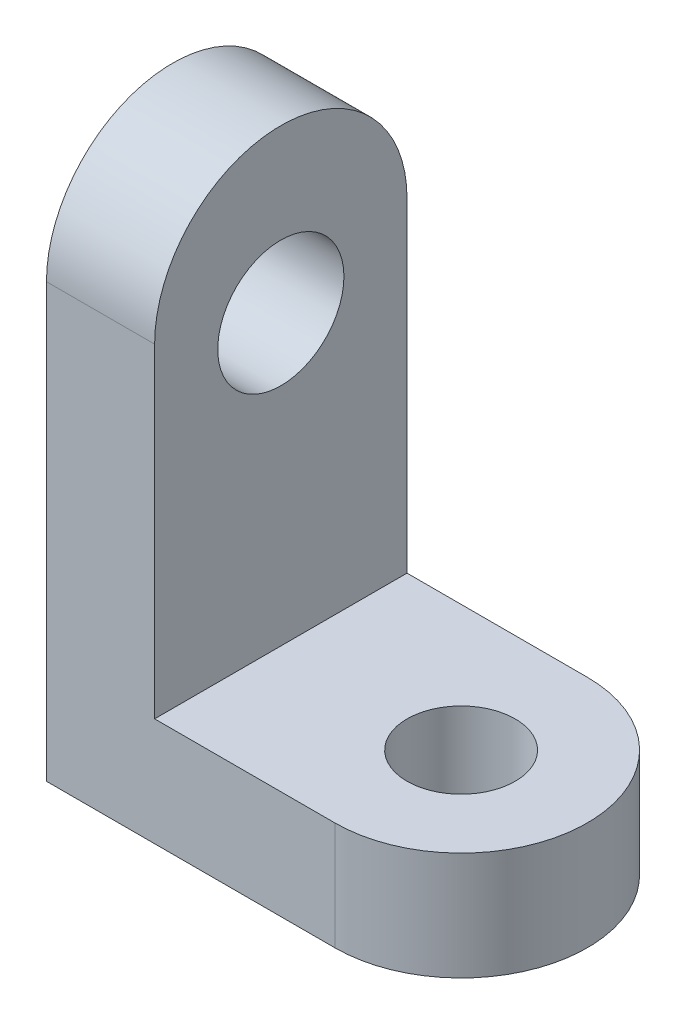
ISO-10303-21;
HEADER;
FILE_DESCRIPTION(('STEP AP214'),'2;1');
FILE_NAME('part.step','',(''),(''),'','','');
FILE_SCHEMA(('AUTOMOTIVE_DESIGN { 1 0 10303 214 1 1 1 1 }'));
ENDSEC;
DATA;
#1=APPLICATION_CONTEXT('core data for automotive mechanical design processes');
#2=APPLICATION_PROTOCOL_DEFINITION('international standard','automotive_design',2000,#1);
#3=PRODUCT_CONTEXT('',#1,'mechanical');
#4=PRODUCT('Part','Part','',(#3));
#5=PRODUCT_RELATED_PRODUCT_CATEGORY('part','',(#4));
#6=PRODUCT_DEFINITION_FORMATION('','',#4);
#7=PRODUCT_DEFINITION_CONTEXT('part definition',#1,'design');
#8=PRODUCT_DEFINITION('design','',#6,#7);
#9=PRODUCT_DEFINITION_SHAPE('','',#8);
#10=(LENGTH_UNIT() NAMED_UNIT(*) SI_UNIT(.MILLI.,.METRE.));
#11=(NAMED_UNIT(*) PLANE_ANGLE_UNIT() SI_UNIT($,.RADIAN.));
#12=(NAMED_UNIT(*) SI_UNIT($,.STERADIAN.) SOLID_ANGLE_UNIT());
#13=UNCERTAINTY_MEASURE_WITH_UNIT(LENGTH_MEASURE(1.E-05),#10,'distance_accuracy_value','');
#14=(GEOMETRIC_REPRESENTATION_CONTEXT(3) GLOBAL_UNCERTAINTY_ASSIGNED_CONTEXT((#13)) GLOBAL_UNIT_ASSIGNED_CONTEXT((#10,
#11,#12)) REPRESENTATION_CONTEXT('',''));
#15=CARTESIAN_POINT('',(0.,0.,0.));
#16=DIRECTION('',(0.,0.,1.));
#17=DIRECTION('',(1.,0.,0.));
#18=AXIS2_PLACEMENT_3D('',#15,#16,#17);
#19=CARTESIAN_POINT('',(-5.,12.,0.));
#20=DIRECTION('',(1.,0.,0.));
#21=DIRECTION('',(0.,0.,-1.));
#22=AXIS2_PLACEMENT_3D('',#19,#20,#21);
#23=CYLINDRICAL_SURFACE('',#22,3.5);
#24=DIRECTION('',(-1.,0.,0.));
#25=VECTOR('',#24,1.);
#26=CARTESIAN_POINT('',(-5.,12.,3.5));
#27=LINE('',#26,#25);
#28=CARTESIAN_POINT('',(-5.,12.,3.5));
#29=VERTEX_POINT('',#28);
#30=CARTESIAN_POINT('',(-8.,12.,3.5));
#31=VERTEX_POINT('',#30);
#32=EDGE_CURVE('E130',#29,#31,#27,.T.);
#33=ORIENTED_EDGE('',*,*,#32,.F.);
#34=CARTESIAN_POINT('',(-5.,12.,0.));
#35=DIRECTION('',(-1.,0.,0.));
#36=DIRECTION('',(0.,0.,1.));
#37=AXIS2_PLACEMENT_3D('',#34,#35,#36);
#38=CIRCLE('',#37,3.5);
#39=CARTESIAN_POINT('',(-5.,12.,-3.5));
#40=VERTEX_POINT('',#39);
#41=EDGE_CURVE('E42',#40,#29,#38,.F.);
#42=ORIENTED_EDGE('',*,*,#41,.F.);
#43=DIRECTION('',(-1.,0.,0.));
#44=VECTOR('',#43,1.);
#45=CARTESIAN_POINT('',(-5.,12.,-3.5));
#46=LINE('',#45,#44);
#47=CARTESIAN_POINT('',(-8.,12.,-3.5));
#48=VERTEX_POINT('',#47);
#49=EDGE_CURVE('E90',#48,#40,#46,.F.);
#50=ORIENTED_EDGE('',*,*,#49,.F.);
#51=CARTESIAN_POINT('',(-8.,12.,0.));
#52=DIRECTION('',(1.,0.,0.));
#53=DIRECTION('',(0.,0.,-1.));
#54=AXIS2_PLACEMENT_3D('',#51,#52,#53);
#55=CIRCLE('',#54,3.5);
#56=EDGE_CURVE('E11',#31,#48,#55,.F.);
#57=ORIENTED_EDGE('',*,*,#56,.F.);
#58=EDGE_LOOP('',(#33,#42,#50,#57));
#59=FACE_BOUND('',#58,.T.);
#60=ADVANCED_FACE('F35',(#59),#23,.T.);
#61=CARTESIAN_POINT('',(0.,3.,3.5));
#62=DIRECTION('',(0.,0.,-1.));
#63=DIRECTION('',(-1.,0.,0.));
#64=AXIS2_PLACEMENT_3D('',#61,#62,#63);
#65=PLANE('',#64);
#66=DIRECTION('',(0.,-1.,0.));
#67=VECTOR('',#66,1.);
#68=CARTESIAN_POINT('',(-5.,15.5,3.5));
#69=LINE('',#68,#67);
#70=CARTESIAN_POINT('',(-5.,3.,3.5));
#71=VERTEX_POINT('',#70);
#72=EDGE_CURVE('E93',#29,#71,#69,.T.);
#73=ORIENTED_EDGE('',*,*,#72,.F.);
#74=ORIENTED_EDGE('',*,*,#32,.T.);
#75=DIRECTION('',(0.,-1.,0.));
#76=VECTOR('',#75,1.);
#77=CARTESIAN_POINT('',(-8.,3.,3.5));
#78=LINE('',#77,#76);
#79=CARTESIAN_POINT('',(-8.,0.,3.5));
#80=VERTEX_POINT('',#79);
#81=EDGE_CURVE('E135',#31,#80,#78,.T.);
#82=ORIENTED_EDGE('',*,*,#81,.T.);
#83=DIRECTION('',(1.,0.,0.));
#84=VECTOR('',#83,1.);
#85=CARTESIAN_POINT('',(0.,0.,3.5));
#86=LINE('',#85,#84);
#87=CARTESIAN_POINT('',(0.,0.,3.5));
#88=VERTEX_POINT('',#87);
#89=EDGE_CURVE('E147',#80,#88,#86,.T.);
#90=ORIENTED_EDGE('',*,*,#89,.T.);
#91=DIRECTION('',(0.,-1.,0.));
#92=VECTOR('',#91,1.);
#93=CARTESIAN_POINT('',(0.,3.,3.5));
#94=LINE('',#93,#92);
#95=CARTESIAN_POINT('',(0.,3.,3.5));
#96=VERTEX_POINT('',#95);
#97=EDGE_CURVE('E127',#96,#88,#94,.T.);
#98=ORIENTED_EDGE('',*,*,#97,.F.);
#99=DIRECTION('',(1.,0.,0.));
#100=VECTOR('',#99,1.);
#101=CARTESIAN_POINT('',(0.,3.,3.5));
#102=LINE('',#101,#100);
#103=EDGE_CURVE('E124',#71,#96,#102,.T.);
#104=ORIENTED_EDGE('',*,*,#103,.F.);
#105=EDGE_LOOP('',(#73,#74,#82,#90,#98,#104));
#106=FACE_BOUND('',#105,.T.);
#107=ADVANCED_FACE('F169',(#106),#65,.F.);
#108=CARTESIAN_POINT('',(0.,3.,0.));
#109=DIRECTION('',(0.,-1.,0.));
#110=DIRECTION('',(0.,0.,-1.));
#111=AXIS2_PLACEMENT_3D('',#108,#109,#110);
#112=CYLINDRICAL_SURFACE('',#111,3.5);
#113=CARTESIAN_POINT('',(0.,0.,0.));
#114=DIRECTION('',(0.,1.,0.));
#115=DIRECTION('',(0.,0.,1.));
#116=AXIS2_PLACEMENT_3D('',#113,#114,#115);
#117=CIRCLE('',#116,3.5);
#118=CARTESIAN_POINT('',(0.,0.,-3.5));
#119=VERTEX_POINT('',#118);
#120=EDGE_CURVE('E145',#88,#119,#117,.T.);
#121=ORIENTED_EDGE('',*,*,#120,.T.);
#122=DIRECTION('',(0.,-1.,0.));
#123=VECTOR('',#122,1.);
#124=CARTESIAN_POINT('',(0.,3.,-3.5));
#125=LINE('',#124,#123);
#126=CARTESIAN_POINT('',(0.,3.,-3.5));
#127=VERTEX_POINT('',#126);
#128=EDGE_CURVE('E131',#127,#119,#125,.T.);
#129=ORIENTED_EDGE('',*,*,#128,.F.);
#130=CARTESIAN_POINT('',(0.,3.,0.));
#131=DIRECTION('',(0.,1.,0.));
#132=DIRECTION('',(0.,0.,1.));
#133=AXIS2_PLACEMENT_3D('',#130,#131,#132);
#134=CIRCLE('',#133,3.5);
#135=EDGE_CURVE('E102',#96,#127,#134,.T.);
#136=ORIENTED_EDGE('',*,*,#135,.F.);
#137=ORIENTED_EDGE('',*,*,#97,.T.);
#138=EDGE_LOOP('',(#121,#129,#136,#137));
#139=FACE_BOUND('',#138,.T.);
#140=ADVANCED_FACE('F173',(#139),#112,.T.);
#141=CARTESIAN_POINT('',(0.,3.,-3.5));
#142=DIRECTION('',(0.,0.,1.));
#143=DIRECTION('',(1.,0.,0.));
#144=AXIS2_PLACEMENT_3D('',#141,#142,#143);
#145=PLANE('',#144);
#146=DIRECTION('',(0.,-1.,0.));
#147=VECTOR('',#146,1.);
#148=CARTESIAN_POINT('',(-8.,3.,-3.5));
#149=LINE('',#148,#147);
#150=CARTESIAN_POINT('',(-8.,0.,-3.5));
#151=VERTEX_POINT('',#150);
#152=EDGE_CURVE('E133',#48,#151,#149,.T.);
#153=ORIENTED_EDGE('',*,*,#152,.F.);
#154=ORIENTED_EDGE('',*,*,#49,.T.);
#155=DIRECTION('',(0.,-1.,0.));
#156=VECTOR('',#155,1.);
#157=CARTESIAN_POINT('',(-5.,15.5,-3.5));
#158=LINE('',#157,#156);
#159=CARTESIAN_POINT('',(-5.,3.,-3.5));
#160=VERTEX_POINT('',#159);
#161=EDGE_CURVE('E84',#40,#160,#158,.T.);
#162=ORIENTED_EDGE('',*,*,#161,.T.);
#163=DIRECTION('',(-1.,0.,0.));
#164=VECTOR('',#163,1.);
#165=CARTESIAN_POINT('',(0.,3.,-3.5));
#166=LINE('',#165,#164);
#167=EDGE_CURVE('E89',#127,#160,#166,.T.);
#168=ORIENTED_EDGE('',*,*,#167,.F.);
#169=ORIENTED_EDGE('',*,*,#128,.T.);
#170=DIRECTION('',(-1.,0.,0.));
#171=VECTOR('',#170,1.);
#172=CARTESIAN_POINT('',(0.,0.,-3.5));
#173=LINE('',#172,#171);
#174=EDGE_CURVE('E142',#119,#151,#173,.T.);
#175=ORIENTED_EDGE('',*,*,#174,.T.);
#176=EDGE_LOOP('',(#153,#154,#162,#168,#169,#175));
#177=FACE_BOUND('',#176,.T.);
#178=ADVANCED_FACE('F87',(#177),#145,.F.);
#179=CARTESIAN_POINT('',(-8.,3.,0.));
#180=DIRECTION('',(1.,0.,0.));
#181=DIRECTION('',(0.,0.,-1.));
#182=AXIS2_PLACEMENT_3D('',#179,#180,#181);
#183=PLANE('',#182);
#184=CARTESIAN_POINT('',(-8.,11.,0.));
#185=DIRECTION('',(1.,0.,0.));
#186=DIRECTION('',(0.,0.,-1.));
#187=AXIS2_PLACEMENT_3D('',#184,#185,#186);
#188=CIRCLE('',#187,1.75);
#189=CARTESIAN_POINT('',(-8.,11.,-1.75));
#190=VERTEX_POINT('',#189);
#191=EDGE_CURVE('E108',#190,#190,#188,.T.);
#192=ORIENTED_EDGE('',*,*,#191,.T.);
#193=EDGE_LOOP('',(#192));
#194=FACE_BOUND('',#193,.T.);
#195=ORIENTED_EDGE('',*,*,#81,.F.);
#196=ORIENTED_EDGE('',*,*,#56,.T.);
#197=ORIENTED_EDGE('',*,*,#152,.T.);
#198=DIRECTION('',(0.,0.,1.));
#199=VECTOR('',#198,1.);
#200=CARTESIAN_POINT('',(-8.,0.,0.));
#201=LINE('',#200,#199);
#202=EDGE_CURVE('E139',#151,#80,#201,.T.);
#203=ORIENTED_EDGE('',*,*,#202,.T.);
#204=EDGE_LOOP('',(#195,#196,#197,#203));
#205=FACE_BOUND('',#204,.T.);
#206=ADVANCED_FACE('F165',(#194,#205),#183,.F.);
#207=CARTESIAN_POINT('',(0.,3.,0.));
#208=DIRECTION('',(0.,-1.,0.));
#209=DIRECTION('',(0.,0.,-1.));
#210=AXIS2_PLACEMENT_3D('',#207,#208,#209);
#211=CYLINDRICAL_SURFACE('',#210,1.5);
#212=CARTESIAN_POINT('',(0.,3.,0.));
#213=DIRECTION('',(0.,1.,0.));
#214=DIRECTION('',(0.,0.,1.));
#215=AXIS2_PLACEMENT_3D('',#212,#213,#214);
#216=CIRCLE('',#215,1.5);
#217=CARTESIAN_POINT('',(0.,3.,1.5));
#218=VERTEX_POINT('',#217);
#219=EDGE_CURVE('E104',#218,#218,#216,.T.);
#220=ORIENTED_EDGE('',*,*,#219,.T.);
#221=EDGE_LOOP('',(#220));
#222=FACE_BOUND('',#221,.T.);
#223=CARTESIAN_POINT('',(0.,0.,0.));
#224=DIRECTION('',(0.,1.,0.));
#225=DIRECTION('',(0.,0.,1.));
#226=AXIS2_PLACEMENT_3D('',#223,#224,#225);
#227=CIRCLE('',#226,1.5);
#228=CARTESIAN_POINT('',(0.,0.,1.5));
#229=VERTEX_POINT('',#228);
#230=EDGE_CURVE('E126',#229,#229,#227,.T.);
#231=ORIENTED_EDGE('',*,*,#230,.F.);
#232=EDGE_LOOP('',(#231));
#233=FACE_BOUND('',#232,.T.);
#234=ADVANCED_FACE('F154',(#222,#233),#211,.F.);
#235=CARTESIAN_POINT('',(0.,3.,0.));
#236=DIRECTION('',(0.,1.,0.));
#237=DIRECTION('',(0.,0.,1.));
#238=AXIS2_PLACEMENT_3D('',#235,#236,#237);
#239=PLANE('',#238);
#240=DIRECTION('',(0.,0.,-1.));
#241=VECTOR('',#240,1.);
#242=CARTESIAN_POINT('',(-5.,3.,-3.5));
#243=LINE('',#242,#241);
#244=EDGE_CURVE('E94',#71,#160,#243,.T.);
#245=ORIENTED_EDGE('',*,*,#244,.F.);
#246=ORIENTED_EDGE('',*,*,#103,.T.);
#247=ORIENTED_EDGE('',*,*,#135,.T.);
#248=ORIENTED_EDGE('',*,*,#167,.T.);
#249=EDGE_LOOP('',(#245,#246,#247,#248));
#250=FACE_BOUND('',#249,.T.);
#251=ORIENTED_EDGE('',*,*,#219,.F.);
#252=EDGE_LOOP('',(#251));
#253=FACE_BOUND('',#252,.T.);
#254=ADVANCED_FACE('F98',(#250,#253),#239,.T.);
#255=CARTESIAN_POINT('',(0.,0.,0.));
#256=DIRECTION('',(0.,1.,0.));
#257=DIRECTION('',(0.,0.,1.));
#258=AXIS2_PLACEMENT_3D('',#255,#256,#257);
#259=PLANE('',#258);
#260=ORIENTED_EDGE('',*,*,#89,.F.);
#261=ORIENTED_EDGE('',*,*,#202,.F.);
#262=ORIENTED_EDGE('',*,*,#174,.F.);
#263=ORIENTED_EDGE('',*,*,#120,.F.);
#264=EDGE_LOOP('',(#260,#261,#262,#263));
#265=FACE_BOUND('',#264,.T.);
#266=ORIENTED_EDGE('',*,*,#230,.T.);
#267=EDGE_LOOP('',(#266));
#268=FACE_BOUND('',#267,.T.);
#269=ADVANCED_FACE('F157',(#265,#268),#259,.F.);
#270=CARTESIAN_POINT('',(-5.,15.5,-3.5));
#271=DIRECTION('',(-1.,0.,0.));
#272=DIRECTION('',(0.,0.,1.));
#273=AXIS2_PLACEMENT_3D('',#270,#271,#272);
#274=PLANE('',#273);
#275=CARTESIAN_POINT('',(-5.,11.,0.));
#276=DIRECTION('',(1.,0.,0.));
#277=DIRECTION('',(0.,0.,-1.));
#278=AXIS2_PLACEMENT_3D('',#275,#276,#277);
#279=CIRCLE('',#278,1.74999999999999);
#280=CARTESIAN_POINT('',(-5.,11.,-1.74999999999999));
#281=VERTEX_POINT('',#280);
#282=EDGE_CURVE('E111',#281,#281,#279,.T.);
#283=ORIENTED_EDGE('',*,*,#282,.F.);
#284=EDGE_LOOP('',(#283));
#285=FACE_BOUND('',#284,.T.);
#286=ORIENTED_EDGE('',*,*,#161,.F.);
#287=ORIENTED_EDGE('',*,*,#41,.T.);
#288=ORIENTED_EDGE('',*,*,#72,.T.);
#289=ORIENTED_EDGE('',*,*,#244,.T.);
#290=EDGE_LOOP('',(#286,#287,#288,#289));
#291=FACE_BOUND('',#290,.T.);
#292=ADVANCED_FACE('F106',(#285,#291),#274,.F.);
#293=CARTESIAN_POINT('',(-5.,11.,0.));
#294=DIRECTION('',(1.,0.,0.));
#295=DIRECTION('',(0.,0.,-1.));
#296=AXIS2_PLACEMENT_3D('',#293,#294,#295);
#297=CYLINDRICAL_SURFACE('',#296,1.74999999999999);
#298=ORIENTED_EDGE('',*,*,#191,.F.);
#299=EDGE_LOOP('',(#298));
#300=FACE_BOUND('',#299,.T.);
#301=ORIENTED_EDGE('',*,*,#282,.T.);
#302=EDGE_LOOP('',(#301));
#303=FACE_BOUND('',#302,.T.);
#304=ADVANCED_FACE('F221',(#300,#303),#297,.F.);
#305=CLOSED_SHELL('',(#60,#107,#140,#178,#206,#234,#254,#269,#292,#304));
#306=MANIFOLD_SOLID_BREP('B2',#305);
#307=ADVANCED_BREP_SHAPE_REPRESENTATION('',(#18,#306),#14);
#308=SHAPE_DEFINITION_REPRESENTATION(#9,#307);
ENDSEC;
END-ISO-10303-21;
